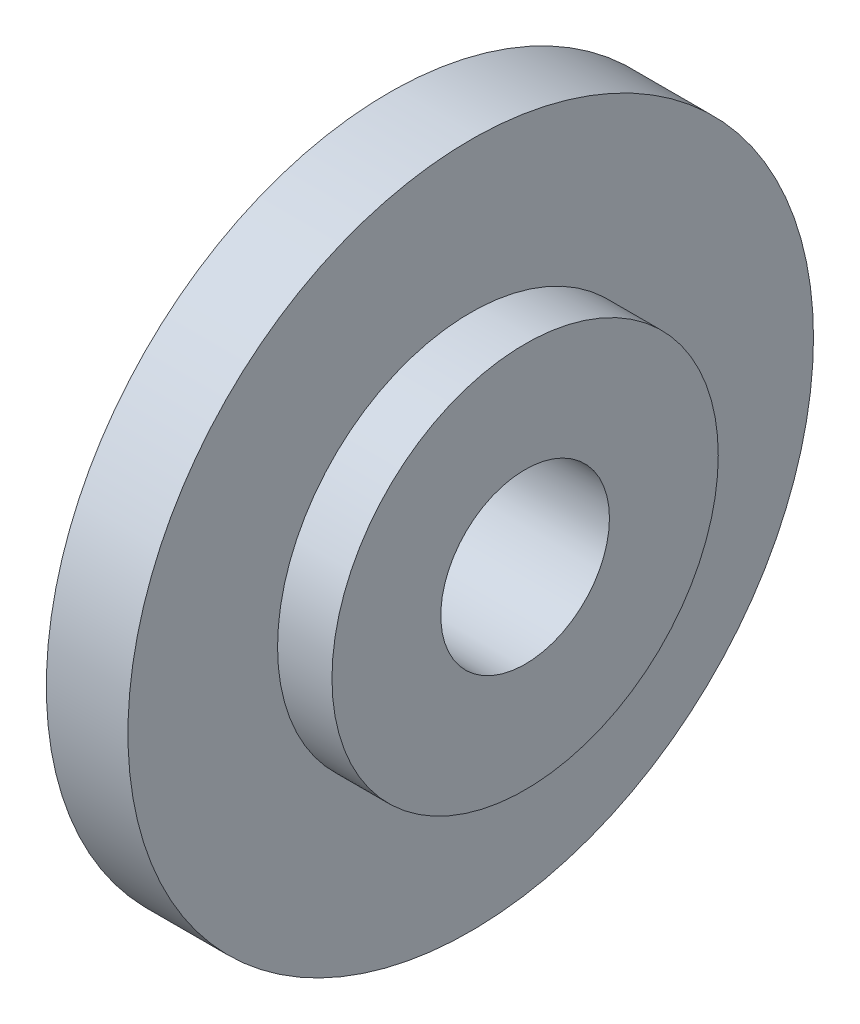
ISO-10303-21;
HEADER;
FILE_DESCRIPTION(('STEP AP214'),'2;1');
FILE_NAME('part.step','',(''),(''),'','','');
FILE_SCHEMA(('AUTOMOTIVE_DESIGN { 1 0 10303 214 1 1 1 1 }'));
ENDSEC;
DATA;
#1=APPLICATION_CONTEXT('core data for automotive mechanical design processes');
#2=APPLICATION_PROTOCOL_DEFINITION('international standard','automotive_design',2000,#1);
#3=PRODUCT_CONTEXT('',#1,'mechanical');
#4=PRODUCT('Part','Part','',(#3));
#5=PRODUCT_RELATED_PRODUCT_CATEGORY('part','',(#4));
#6=PRODUCT_DEFINITION_FORMATION('','',#4);
#7=PRODUCT_DEFINITION_CONTEXT('part definition',#1,'design');
#8=PRODUCT_DEFINITION('design','',#6,#7);
#9=PRODUCT_DEFINITION_SHAPE('','',#8);
#10=(LENGTH_UNIT() NAMED_UNIT(*) SI_UNIT(.MILLI.,.METRE.));
#11=(NAMED_UNIT(*) PLANE_ANGLE_UNIT() SI_UNIT($,.RADIAN.));
#12=(NAMED_UNIT(*) SI_UNIT($,.STERADIAN.) SOLID_ANGLE_UNIT());
#13=UNCERTAINTY_MEASURE_WITH_UNIT(LENGTH_MEASURE(1.E-05),#10,'distance_accuracy_value','');
#14=(GEOMETRIC_REPRESENTATION_CONTEXT(3) GLOBAL_UNCERTAINTY_ASSIGNED_CONTEXT((#13)) GLOBAL_UNIT_ASSIGNED_CONTEXT((#10,
#11,#12)) REPRESENTATION_CONTEXT('',''));
#15=CARTESIAN_POINT('',(0.,0.,0.));
#16=DIRECTION('',(0.,0.,1.));
#17=DIRECTION('',(1.,0.,0.));
#18=AXIS2_PLACEMENT_3D('',#15,#16,#17);
#19=CARTESIAN_POINT('',(3.,0.,0.));
#20=DIRECTION('',(-1.,0.,0.));
#21=DIRECTION('',(0.,0.,1.));
#22=AXIS2_PLACEMENT_3D('',#19,#20,#21);
#23=CYLINDRICAL_SURFACE('',#22,12.6);
#24=CARTESIAN_POINT('',(3.,0.,0.));
#25=DIRECTION('',(1.,0.,0.));
#26=DIRECTION('',(0.,0.,-1.));
#27=AXIS2_PLACEMENT_3D('',#24,#25,#26);
#28=CIRCLE('',#27,12.6);
#29=CARTESIAN_POINT('',(3.,0.,-12.6));
#30=VERTEX_POINT('',#29);
#31=EDGE_CURVE('E10',#30,#30,#28,.T.);
#32=ORIENTED_EDGE('',*,*,#31,.F.);
#33=EDGE_LOOP('',(#32));
#34=FACE_BOUND('',#33,.T.);
#35=CARTESIAN_POINT('',(0.,0.,0.));
#36=DIRECTION('',(1.,0.,0.));
#37=DIRECTION('',(0.,0.,-1.));
#38=AXIS2_PLACEMENT_3D('',#35,#36,#37);
#39=CIRCLE('',#38,12.6);
#40=CARTESIAN_POINT('',(0.,0.,-12.6));
#41=VERTEX_POINT('',#40);
#42=EDGE_CURVE('E36',#41,#41,#39,.T.);
#43=ORIENTED_EDGE('',*,*,#42,.T.);
#44=EDGE_LOOP('',(#43));
#45=FACE_BOUND('',#44,.T.);
#46=ADVANCED_FACE('F33',(#34,#45),#23,.T.);
#47=CARTESIAN_POINT('',(3.,0.,0.));
#48=DIRECTION('',(1.,0.,0.));
#49=DIRECTION('',(0.,0.,-1.));
#50=AXIS2_PLACEMENT_3D('',#47,#48,#49);
#51=PLANE('',#50);
#52=CARTESIAN_POINT('',(3.,0.,0.));
#53=DIRECTION('',(1.,0.,0.));
#54=DIRECTION('',(0.,0.,-1.));
#55=AXIS2_PLACEMENT_3D('',#52,#53,#54);
#56=CIRCLE('',#55,7.1);
#57=CARTESIAN_POINT('',(3.,0.,-7.1));
#58=VERTEX_POINT('',#57);
#59=EDGE_CURVE('E40',#58,#58,#56,.T.);
#60=ORIENTED_EDGE('',*,*,#59,.F.);
#61=EDGE_LOOP('',(#60));
#62=FACE_BOUND('',#61,.T.);
#63=ORIENTED_EDGE('',*,*,#31,.T.);
#64=EDGE_LOOP('',(#63));
#65=FACE_BOUND('',#64,.T.);
#66=ADVANCED_FACE('F75',(#62,#65),#51,.T.);
#67=CARTESIAN_POINT('',(0.,0.,0.));
#68=DIRECTION('',(1.,0.,0.));
#69=DIRECTION('',(0.,0.,-1.));
#70=AXIS2_PLACEMENT_3D('',#67,#68,#69);
#71=PLANE('',#70);
#72=ORIENTED_EDGE('',*,*,#42,.F.);
#73=EDGE_LOOP('',(#72));
#74=FACE_BOUND('',#73,.T.);
#75=CARTESIAN_POINT('',(0.,0.,0.));
#76=DIRECTION('',(1.,0.,0.));
#77=DIRECTION('',(0.,0.,-1.));
#78=AXIS2_PLACEMENT_3D('',#75,#76,#77);
#79=CIRCLE('',#78,3.1);
#80=CARTESIAN_POINT('',(0.,0.,-3.1));
#81=VERTEX_POINT('',#80);
#82=EDGE_CURVE('E46',#81,#81,#79,.T.);
#83=ORIENTED_EDGE('',*,*,#82,.T.);
#84=EDGE_LOOP('',(#83));
#85=FACE_BOUND('',#84,.T.);
#86=ADVANCED_FACE('F72',(#74,#85),#71,.F.);
#87=CARTESIAN_POINT('',(5.,0.,0.));
#88=DIRECTION('',(-1.,0.,0.));
#89=DIRECTION('',(0.,0.,1.));
#90=AXIS2_PLACEMENT_3D('',#87,#88,#89);
#91=CYLINDRICAL_SURFACE('',#90,3.1);
#92=CARTESIAN_POINT('',(5.,0.,0.));
#93=DIRECTION('',(1.,0.,0.));
#94=DIRECTION('',(0.,0.,-1.));
#95=AXIS2_PLACEMENT_3D('',#92,#93,#94);
#96=CIRCLE('',#95,3.1);
#97=CARTESIAN_POINT('',(5.,0.,-3.1));
#98=VERTEX_POINT('',#97);
#99=EDGE_CURVE('E49',#98,#98,#96,.T.);
#100=ORIENTED_EDGE('',*,*,#99,.T.);
#101=EDGE_LOOP('',(#100));
#102=FACE_BOUND('',#101,.T.);
#103=ORIENTED_EDGE('',*,*,#82,.F.);
#104=EDGE_LOOP('',(#103));
#105=FACE_BOUND('',#104,.T.);
#106=ADVANCED_FACE('F56',(#102,#105),#91,.F.);
#107=CARTESIAN_POINT('',(5.,0.,0.));
#108=DIRECTION('',(-1.,0.,0.));
#109=DIRECTION('',(0.,0.,1.));
#110=AXIS2_PLACEMENT_3D('',#107,#108,#109);
#111=CYLINDRICAL_SURFACE('',#110,7.1);
#112=ORIENTED_EDGE('',*,*,#59,.T.);
#113=EDGE_LOOP('',(#112));
#114=FACE_BOUND('',#113,.T.);
#115=CARTESIAN_POINT('',(5.,0.,0.));
#116=DIRECTION('',(1.,0.,0.));
#117=DIRECTION('',(0.,0.,-1.));
#118=AXIS2_PLACEMENT_3D('',#115,#116,#117);
#119=CIRCLE('',#118,7.1);
#120=CARTESIAN_POINT('',(5.,0.,-7.1));
#121=VERTEX_POINT('',#120);
#122=EDGE_CURVE('E50',#121,#121,#119,.T.);
#123=ORIENTED_EDGE('',*,*,#122,.F.);
#124=EDGE_LOOP('',(#123));
#125=FACE_BOUND('',#124,.T.);
#126=ADVANCED_FACE('F62',(#114,#125),#111,.T.);
#127=CARTESIAN_POINT('',(5.,0.,0.));
#128=DIRECTION('',(1.,0.,0.));
#129=DIRECTION('',(0.,0.,-1.));
#130=AXIS2_PLACEMENT_3D('',#127,#128,#129);
#131=PLANE('',#130);
#132=ORIENTED_EDGE('',*,*,#99,.F.);
#133=EDGE_LOOP('',(#132));
#134=FACE_BOUND('',#133,.T.);
#135=ORIENTED_EDGE('',*,*,#122,.T.);
#136=EDGE_LOOP('',(#135));
#137=FACE_BOUND('',#136,.T.);
#138=ADVANCED_FACE('F59',(#134,#137),#131,.T.);
#139=CLOSED_SHELL('',(#46,#66,#86,#106,#126,#138));
#140=MANIFOLD_SOLID_BREP('B2',#139);
#141=ADVANCED_BREP_SHAPE_REPRESENTATION('',(#18,#140),#14);
#142=SHAPE_DEFINITION_REPRESENTATION(#9,#141);
ENDSEC;
END-ISO-10303-21;
